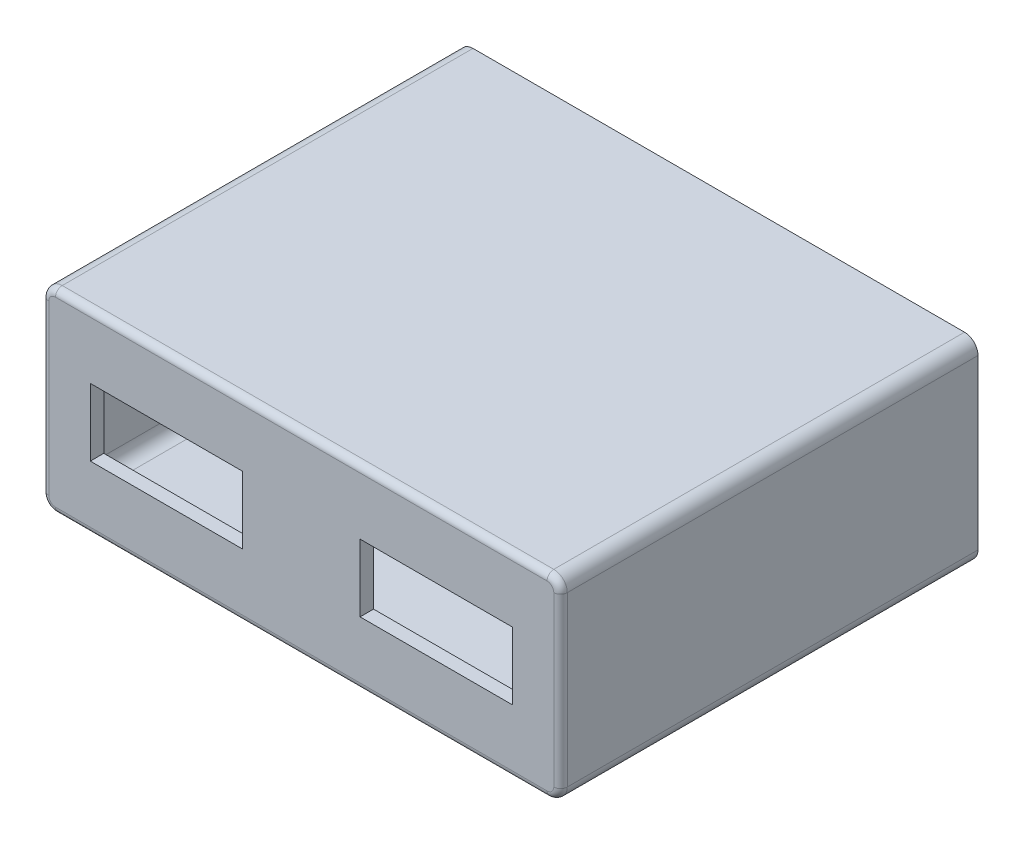
ISO-10303-21;
HEADER;
FILE_DESCRIPTION(('STEP AP214'),'2;1');
FILE_NAME('part.step','',(''),(''),'','','');
FILE_SCHEMA(('AUTOMOTIVE_DESIGN { 1 0 10303 214 1 1 1 1 }'));
ENDSEC;
DATA;
#1=APPLICATION_CONTEXT('core data for automotive mechanical design processes');
#2=APPLICATION_PROTOCOL_DEFINITION('international standard','automotive_design',2000,#1);
#3=PRODUCT_CONTEXT('',#1,'mechanical');
#4=PRODUCT('Part','Part','',(#3));
#5=PRODUCT_RELATED_PRODUCT_CATEGORY('part','',(#4));
#6=PRODUCT_DEFINITION_FORMATION('','',#4);
#7=PRODUCT_DEFINITION_CONTEXT('part definition',#1,'design');
#8=PRODUCT_DEFINITION('design','',#6,#7);
#9=PRODUCT_DEFINITION_SHAPE('','',#8);
#10=(LENGTH_UNIT() NAMED_UNIT(*) SI_UNIT(.MILLI.,.METRE.));
#11=(NAMED_UNIT(*) PLANE_ANGLE_UNIT() SI_UNIT($,.RADIAN.));
#12=(NAMED_UNIT(*) SI_UNIT($,.STERADIAN.) SOLID_ANGLE_UNIT());
#13=UNCERTAINTY_MEASURE_WITH_UNIT(LENGTH_MEASURE(1.E-05),#10,'distance_accuracy_value','');
#14=(GEOMETRIC_REPRESENTATION_CONTEXT(3) GLOBAL_UNCERTAINTY_ASSIGNED_CONTEXT((#13)) GLOBAL_UNIT_ASSIGNED_CONTEXT((#10,
#11,#12)) REPRESENTATION_CONTEXT('',''));
#15=CARTESIAN_POINT('',(0.,0.,0.));
#16=DIRECTION('',(0.,0.,1.));
#17=DIRECTION('',(1.,0.,0.));
#18=AXIS2_PLACEMENT_3D('',#15,#16,#17);
#19=CARTESIAN_POINT('',(-36.5,-12.5,55.));
#20=DIRECTION('',(0.,0.,-1.));
#21=DIRECTION('',(-1.,0.,0.));
#22=AXIS2_PLACEMENT_3D('',#19,#20,#21);
#23=CYLINDRICAL_SURFACE('',#22,2.);
#24=DIRECTION('',(0.,0.,-1.));
#25=VECTOR('',#24,1.);
#26=CARTESIAN_POINT('',(-36.5,-14.5,55.));
#27=LINE('',#26,#25);
#28=CARTESIAN_POINT('',(-36.5,-14.5,56.));
#29=VERTEX_POINT('',#28);
#30=CARTESIAN_POINT('',(-36.5,-14.5,-5.));
#31=VERTEX_POINT('',#30);
#32=EDGE_CURVE('E398',#29,#31,#27,.T.);
#33=ORIENTED_EDGE('',*,*,#32,.F.);
#34=CARTESIAN_POINT('',(-36.5,-12.5,56.));
#35=DIRECTION('',(0.,0.,1.));
#36=DIRECTION('',(1.,0.,0.));
#37=AXIS2_PLACEMENT_3D('',#34,#35,#36);
#38=CIRCLE('',#37,2.);
#39=CARTESIAN_POINT('',(-38.5,-12.5,56.));
#40=VERTEX_POINT('',#39);
#41=EDGE_CURVE('E426',#29,#40,#38,.F.);
#42=ORIENTED_EDGE('',*,*,#41,.T.);
#43=DIRECTION('',(0.,0.,-1.));
#44=VECTOR('',#43,1.);
#45=CARTESIAN_POINT('',(-38.5,-12.5,55.));
#46=LINE('',#45,#44);
#47=CARTESIAN_POINT('',(-38.5,-12.5,-5.));
#48=VERTEX_POINT('',#47);
#49=EDGE_CURVE('E384',#40,#48,#46,.T.);
#50=ORIENTED_EDGE('',*,*,#49,.T.);
#51=CARTESIAN_POINT('',(-36.5,-12.5,-5.));
#52=DIRECTION('',(0.,0.,-1.));
#53=DIRECTION('',(-1.,0.,0.));
#54=AXIS2_PLACEMENT_3D('',#51,#52,#53);
#55=CIRCLE('',#54,2.);
#56=EDGE_CURVE('E262',#31,#48,#55,.T.);
#57=ORIENTED_EDGE('',*,*,#56,.F.);
#58=EDGE_LOOP('',(#33,#42,#50,#57));
#59=FACE_BOUND('',#58,.T.);
#60=ADVANCED_FACE('F33',(#59),#23,.T.);
#61=CARTESIAN_POINT('',(36.5,-14.5,55.));
#62=DIRECTION('',(0.,1.,0.));
#63=DIRECTION('',(-1.,0.,0.));
#64=AXIS2_PLACEMENT_3D('',#61,#62,#63);
#65=PLANE('',#64);
#66=DIRECTION('',(0.,0.,-1.));
#67=VECTOR('',#66,1.);
#68=CARTESIAN_POINT('',(36.5,-14.5,55.));
#69=LINE('',#68,#67);
#70=CARTESIAN_POINT('',(36.5,-14.5,56.));
#71=VERTEX_POINT('',#70);
#72=CARTESIAN_POINT('',(36.5,-14.5,-5.));
#73=VERTEX_POINT('',#72);
#74=EDGE_CURVE('E396',#71,#73,#69,.T.);
#75=ORIENTED_EDGE('',*,*,#74,.F.);
#76=DIRECTION('',(1.,0.,0.));
#77=VECTOR('',#76,1.);
#78=CARTESIAN_POINT('',(-36.5,-14.5,56.));
#79=LINE('',#78,#77);
#80=EDGE_CURVE('E424',#71,#29,#79,.F.);
#81=ORIENTED_EDGE('',*,*,#80,.T.);
#82=ORIENTED_EDGE('',*,*,#32,.T.);
#83=DIRECTION('',(-1.,0.,0.));
#84=VECTOR('',#83,1.);
#85=CARTESIAN_POINT('',(36.5,-14.5,-5.));
#86=LINE('',#85,#84);
#87=EDGE_CURVE('E283',#73,#31,#86,.T.);
#88=ORIENTED_EDGE('',*,*,#87,.F.);
#89=EDGE_LOOP('',(#75,#81,#82,#88));
#90=FACE_BOUND('',#89,.T.);
#91=ADVANCED_FACE('F470',(#90),#65,.F.);
#92=CARTESIAN_POINT('',(36.5,-12.5,55.));
#93=DIRECTION('',(0.,0.,-1.));
#94=DIRECTION('',(-1.,0.,0.));
#95=AXIS2_PLACEMENT_3D('',#92,#93,#94);
#96=CYLINDRICAL_SURFACE('',#95,2.);
#97=DIRECTION('',(0.,0.,-1.));
#98=VECTOR('',#97,1.);
#99=CARTESIAN_POINT('',(38.5,-12.5,55.));
#100=LINE('',#99,#98);
#101=CARTESIAN_POINT('',(38.5,-12.5,56.));
#102=VERTEX_POINT('',#101);
#103=CARTESIAN_POINT('',(38.5,-12.5,-5.));
#104=VERTEX_POINT('',#103);
#105=EDGE_CURVE('E394',#102,#104,#100,.T.);
#106=ORIENTED_EDGE('',*,*,#105,.F.);
#107=CARTESIAN_POINT('',(36.5,-12.5,56.));
#108=DIRECTION('',(0.,0.,1.));
#109=DIRECTION('',(1.,0.,0.));
#110=AXIS2_PLACEMENT_3D('',#107,#108,#109);
#111=CIRCLE('',#110,2.);
#112=EDGE_CURVE('E422',#102,#71,#111,.F.);
#113=ORIENTED_EDGE('',*,*,#112,.T.);
#114=ORIENTED_EDGE('',*,*,#74,.T.);
#115=CARTESIAN_POINT('',(36.5,-12.5,-5.));
#116=DIRECTION('',(0.,0.,-1.));
#117=DIRECTION('',(-1.,0.,0.));
#118=AXIS2_PLACEMENT_3D('',#115,#116,#117);
#119=CIRCLE('',#118,2.);
#120=EDGE_CURVE('E280',#104,#73,#119,.T.);
#121=ORIENTED_EDGE('',*,*,#120,.F.);
#122=EDGE_LOOP('',(#106,#113,#114,#121));
#123=FACE_BOUND('',#122,.T.);
#124=ADVANCED_FACE('F473',(#123),#96,.T.);
#125=CARTESIAN_POINT('',(38.5,-12.5,55.));
#126=DIRECTION('',(-1.,0.,0.));
#127=DIRECTION('',(0.,0.,1.));
#128=AXIS2_PLACEMENT_3D('',#125,#126,#127);
#129=PLANE('',#128);
#130=DIRECTION('',(0.,0.,-1.));
#131=VECTOR('',#130,1.);
#132=CARTESIAN_POINT('',(38.5,12.5,55.));
#133=LINE('',#132,#131);
#134=CARTESIAN_POINT('',(38.5,12.5,56.));
#135=VERTEX_POINT('',#134);
#136=CARTESIAN_POINT('',(38.5,12.5,-5.));
#137=VERTEX_POINT('',#136);
#138=EDGE_CURVE('E392',#135,#137,#133,.T.);
#139=ORIENTED_EDGE('',*,*,#138,.F.);
#140=DIRECTION('',(0.,1.,0.));
#141=VECTOR('',#140,1.);
#142=CARTESIAN_POINT('',(38.5,-12.5,56.));
#143=LINE('',#142,#141);
#144=EDGE_CURVE('E420',#135,#102,#143,.F.);
#145=ORIENTED_EDGE('',*,*,#144,.T.);
#146=ORIENTED_EDGE('',*,*,#105,.T.);
#147=DIRECTION('',(0.,-1.,0.));
#148=VECTOR('',#147,1.);
#149=CARTESIAN_POINT('',(38.5,12.5,-5.));
#150=LINE('',#149,#148);
#151=EDGE_CURVE('E277',#137,#104,#150,.T.);
#152=ORIENTED_EDGE('',*,*,#151,.F.);
#153=EDGE_LOOP('',(#139,#145,#146,#152));
#154=FACE_BOUND('',#153,.T.);
#155=ADVANCED_FACE('F527',(#154),#129,.F.);
#156=CARTESIAN_POINT('',(36.5,12.5,55.));
#157=DIRECTION('',(0.,0.,-1.));
#158=DIRECTION('',(-1.,0.,0.));
#159=AXIS2_PLACEMENT_3D('',#156,#157,#158);
#160=CYLINDRICAL_SURFACE('',#159,2.);
#161=DIRECTION('',(0.,0.,-1.));
#162=VECTOR('',#161,1.);
#163=CARTESIAN_POINT('',(36.5,14.5,55.));
#164=LINE('',#163,#162);
#165=CARTESIAN_POINT('',(36.5,14.5,56.));
#166=VERTEX_POINT('',#165);
#167=CARTESIAN_POINT('',(36.5,14.5,-5.));
#168=VERTEX_POINT('',#167);
#169=EDGE_CURVE('E390',#166,#168,#164,.T.);
#170=ORIENTED_EDGE('',*,*,#169,.F.);
#171=CARTESIAN_POINT('',(36.5,12.5,56.));
#172=DIRECTION('',(0.,0.,1.));
#173=DIRECTION('',(1.,0.,0.));
#174=AXIS2_PLACEMENT_3D('',#171,#172,#173);
#175=CIRCLE('',#174,2.);
#176=EDGE_CURVE('E417',#166,#135,#175,.F.);
#177=ORIENTED_EDGE('',*,*,#176,.T.);
#178=ORIENTED_EDGE('',*,*,#138,.T.);
#179=CARTESIAN_POINT('',(36.5,12.5,-5.));
#180=DIRECTION('',(0.,0.,-1.));
#181=DIRECTION('',(-1.,0.,0.));
#182=AXIS2_PLACEMENT_3D('',#179,#180,#181);
#183=CIRCLE('',#182,2.);
#184=EDGE_CURVE('E274',#168,#137,#183,.T.);
#185=ORIENTED_EDGE('',*,*,#184,.F.);
#186=EDGE_LOOP('',(#170,#177,#178,#185));
#187=FACE_BOUND('',#186,.T.);
#188=ADVANCED_FACE('F506',(#187),#160,.T.);
#189=CARTESIAN_POINT('',(36.5,14.5,55.));
#190=DIRECTION('',(0.,-1.,0.));
#191=DIRECTION('',(1.,0.,0.));
#192=AXIS2_PLACEMENT_3D('',#189,#190,#191);
#193=PLANE('',#192);
#194=DIRECTION('',(0.,0.,-1.));
#195=VECTOR('',#194,1.);
#196=CARTESIAN_POINT('',(-36.5,14.5,55.));
#197=LINE('',#196,#195);
#198=CARTESIAN_POINT('',(-36.5,14.5,56.));
#199=VERTEX_POINT('',#198);
#200=CARTESIAN_POINT('',(-36.5,14.5,-5.));
#201=VERTEX_POINT('',#200);
#202=EDGE_CURVE('E388',#199,#201,#197,.T.);
#203=ORIENTED_EDGE('',*,*,#202,.F.);
#204=DIRECTION('',(-1.,0.,0.));
#205=VECTOR('',#204,1.);
#206=CARTESIAN_POINT('',(36.5,14.5,56.));
#207=LINE('',#206,#205);
#208=EDGE_CURVE('E11',#199,#166,#207,.F.);
#209=ORIENTED_EDGE('',*,*,#208,.T.);
#210=ORIENTED_EDGE('',*,*,#169,.T.);
#211=DIRECTION('',(1.,0.,0.));
#212=VECTOR('',#211,1.);
#213=CARTESIAN_POINT('',(-36.5,14.5,-5.));
#214=LINE('',#213,#212);
#215=EDGE_CURVE('E271',#201,#168,#214,.T.);
#216=ORIENTED_EDGE('',*,*,#215,.F.);
#217=EDGE_LOOP('',(#203,#209,#210,#216));
#218=FACE_BOUND('',#217,.T.);
#219=ADVANCED_FACE('F501',(#218),#193,.F.);
#220=CARTESIAN_POINT('',(-36.5,12.5,55.));
#221=DIRECTION('',(0.,0.,-1.));
#222=DIRECTION('',(-1.,0.,0.));
#223=AXIS2_PLACEMENT_3D('',#220,#221,#222);
#224=CYLINDRICAL_SURFACE('',#223,2.);
#225=DIRECTION('',(0.,0.,-1.));
#226=VECTOR('',#225,1.);
#227=CARTESIAN_POINT('',(-38.5,12.5,55.));
#228=LINE('',#227,#226);
#229=CARTESIAN_POINT('',(-38.5,12.5,56.));
#230=VERTEX_POINT('',#229);
#231=CARTESIAN_POINT('',(-38.5,12.5,-5.));
#232=VERTEX_POINT('',#231);
#233=EDGE_CURVE('E386',#230,#232,#228,.T.);
#234=ORIENTED_EDGE('',*,*,#233,.F.);
#235=CARTESIAN_POINT('',(-36.5,12.5,56.));
#236=DIRECTION('',(0.,0.,1.));
#237=DIRECTION('',(1.,0.,0.));
#238=AXIS2_PLACEMENT_3D('',#235,#236,#237);
#239=CIRCLE('',#238,2.);
#240=EDGE_CURVE('E42',#230,#199,#239,.F.);
#241=ORIENTED_EDGE('',*,*,#240,.T.);
#242=ORIENTED_EDGE('',*,*,#202,.T.);
#243=CARTESIAN_POINT('',(-36.5,12.5,-5.));
#244=DIRECTION('',(0.,0.,-1.));
#245=DIRECTION('',(-1.,0.,0.));
#246=AXIS2_PLACEMENT_3D('',#243,#244,#245);
#247=CIRCLE('',#246,2.);
#248=EDGE_CURVE('E268',#232,#201,#247,.T.);
#249=ORIENTED_EDGE('',*,*,#248,.F.);
#250=EDGE_LOOP('',(#234,#241,#242,#249));
#251=FACE_BOUND('',#250,.T.);
#252=ADVANCED_FACE('F535',(#251),#224,.T.);
#253=CARTESIAN_POINT('',(-38.5,-12.5,55.));
#254=DIRECTION('',(1.,0.,0.));
#255=DIRECTION('',(0.,0.,-1.));
#256=AXIS2_PLACEMENT_3D('',#253,#254,#255);
#257=PLANE('',#256);
#258=ORIENTED_EDGE('',*,*,#49,.F.);
#259=DIRECTION('',(0.,-1.,0.));
#260=VECTOR('',#259,1.);
#261=CARTESIAN_POINT('',(-38.5,12.5,56.));
#262=LINE('',#261,#260);
#263=EDGE_CURVE('E57',#40,#230,#262,.F.);
#264=ORIENTED_EDGE('',*,*,#263,.T.);
#265=ORIENTED_EDGE('',*,*,#233,.T.);
#266=DIRECTION('',(0.,1.,0.));
#267=VECTOR('',#266,1.);
#268=CARTESIAN_POINT('',(-38.5,-12.5,-5.));
#269=LINE('',#268,#267);
#270=EDGE_CURVE('E265',#48,#232,#269,.T.);
#271=ORIENTED_EDGE('',*,*,#270,.F.);
#272=EDGE_LOOP('',(#258,#264,#265,#271));
#273=FACE_BOUND('',#272,.T.);
#274=ADVANCED_FACE('F463',(#273),#257,.F.);
#275=CARTESIAN_POINT('',(34.5,-10.5,55.));
#276=DIRECTION('',(0.,0.,-1.));
#277=DIRECTION('',(-1.,0.,0.));
#278=AXIS2_PLACEMENT_3D('',#275,#276,#277);
#279=CYLINDRICAL_SURFACE('',#278,2.);
#280=DIRECTION('',(0.,0.,-1.));
#281=VECTOR('',#280,1.);
#282=CARTESIAN_POINT('',(36.5,-10.5,55.));
#283=LINE('',#282,#281);
#284=CARTESIAN_POINT('',(36.5,-10.5,55.));
#285=VERTEX_POINT('',#284);
#286=CARTESIAN_POINT('',(36.5,-10.5,-5.));
#287=VERTEX_POINT('',#286);
#288=EDGE_CURVE('E236',#285,#287,#283,.T.);
#289=ORIENTED_EDGE('',*,*,#288,.T.);
#290=CARTESIAN_POINT('',(34.5,-10.5,-5.));
#291=DIRECTION('',(0.,0.,-1.));
#292=DIRECTION('',(-1.,0.,0.));
#293=AXIS2_PLACEMENT_3D('',#290,#291,#292);
#294=CIRCLE('',#293,2.);
#295=CARTESIAN_POINT('',(34.5,-12.5,-5.));
#296=VERTEX_POINT('',#295);
#297=EDGE_CURVE('E233',#287,#296,#294,.T.);
#298=ORIENTED_EDGE('',*,*,#297,.T.);
#299=DIRECTION('',(0.,0.,-1.));
#300=VECTOR('',#299,1.);
#301=CARTESIAN_POINT('',(34.5,-12.5,55.));
#302=LINE('',#301,#300);
#303=CARTESIAN_POINT('',(34.5,-12.5,55.));
#304=VERTEX_POINT('',#303);
#305=EDGE_CURVE('E220',#304,#296,#302,.T.);
#306=ORIENTED_EDGE('',*,*,#305,.F.);
#307=CARTESIAN_POINT('',(34.5,-10.5,55.));
#308=DIRECTION('',(0.,0.,1.));
#309=DIRECTION('',(1.,0.,0.));
#310=AXIS2_PLACEMENT_3D('',#307,#308,#309);
#311=CIRCLE('',#310,2.);
#312=EDGE_CURVE('E351',#304,#285,#311,.T.);
#313=ORIENTED_EDGE('',*,*,#312,.T.);
#314=EDGE_LOOP('',(#289,#298,#306,#313));
#315=FACE_BOUND('',#314,.T.);
#316=ADVANCED_FACE('F234',(#315),#279,.F.);
#317=CARTESIAN_POINT('',(36.5,-10.5,55.));
#318=DIRECTION('',(-1.,0.,0.));
#319=DIRECTION('',(0.,0.,1.));
#320=AXIS2_PLACEMENT_3D('',#317,#318,#319);
#321=PLANE('',#320);
#322=DIRECTION('',(0.,0.,-1.));
#323=VECTOR('',#322,1.);
#324=CARTESIAN_POINT('',(36.5,10.5,55.));
#325=LINE('',#324,#323);
#326=CARTESIAN_POINT('',(36.5,10.5,55.));
#327=VERTEX_POINT('',#326);
#328=CARTESIAN_POINT('',(36.5,10.5,-5.));
#329=VERTEX_POINT('',#328);
#330=EDGE_CURVE('E381',#327,#329,#325,.T.);
#331=ORIENTED_EDGE('',*,*,#330,.T.);
#332=DIRECTION('',(0.,-1.,0.));
#333=VECTOR('',#332,1.);
#334=CARTESIAN_POINT('',(36.5,10.5,-5.));
#335=LINE('',#334,#333);
#336=EDGE_CURVE('E260',#329,#287,#335,.T.);
#337=ORIENTED_EDGE('',*,*,#336,.T.);
#338=ORIENTED_EDGE('',*,*,#288,.F.);
#339=DIRECTION('',(0.,1.,0.));
#340=VECTOR('',#339,1.);
#341=CARTESIAN_POINT('',(36.5,-10.5,55.));
#342=LINE('',#341,#340);
#343=EDGE_CURVE('E353',#285,#327,#342,.T.);
#344=ORIENTED_EDGE('',*,*,#343,.T.);
#345=EDGE_LOOP('',(#331,#337,#338,#344));
#346=FACE_BOUND('',#345,.T.);
#347=ADVANCED_FACE('F542',(#346),#321,.T.);
#348=CARTESIAN_POINT('',(34.5,10.5,55.));
#349=DIRECTION('',(0.,0.,-1.));
#350=DIRECTION('',(-1.,0.,0.));
#351=AXIS2_PLACEMENT_3D('',#348,#349,#350);
#352=CYLINDRICAL_SURFACE('',#351,2.);
#353=DIRECTION('',(0.,0.,-1.));
#354=VECTOR('',#353,1.);
#355=CARTESIAN_POINT('',(34.5,12.5,55.));
#356=LINE('',#355,#354);
#357=CARTESIAN_POINT('',(34.5,12.5,55.));
#358=VERTEX_POINT('',#357);
#359=CARTESIAN_POINT('',(34.5,12.5,-5.));
#360=VERTEX_POINT('',#359);
#361=EDGE_CURVE('E379',#358,#360,#356,.T.);
#362=ORIENTED_EDGE('',*,*,#361,.T.);
#363=CARTESIAN_POINT('',(34.5,10.5,-5.));
#364=DIRECTION('',(0.,0.,-1.));
#365=DIRECTION('',(-1.,0.,0.));
#366=AXIS2_PLACEMENT_3D('',#363,#364,#365);
#367=CIRCLE('',#366,2.);
#368=EDGE_CURVE('E257',#360,#329,#367,.T.);
#369=ORIENTED_EDGE('',*,*,#368,.T.);
#370=ORIENTED_EDGE('',*,*,#330,.F.);
#371=CARTESIAN_POINT('',(34.5,10.5,55.));
#372=DIRECTION('',(0.,0.,1.));
#373=DIRECTION('',(-1.,0.,0.));
#374=AXIS2_PLACEMENT_3D('',#371,#372,#373);
#375=CIRCLE('',#374,2.);
#376=EDGE_CURVE('E356',#327,#358,#375,.T.);
#377=ORIENTED_EDGE('',*,*,#376,.T.);
#378=EDGE_LOOP('',(#362,#369,#370,#377));
#379=FACE_BOUND('',#378,.T.);
#380=ADVANCED_FACE('F545',(#379),#352,.F.);
#381=CARTESIAN_POINT('',(-34.5,12.5,55.));
#382=DIRECTION('',(0.,-1.,0.));
#383=DIRECTION('',(0.,0.,-1.));
#384=AXIS2_PLACEMENT_3D('',#381,#382,#383);
#385=PLANE('',#384);
#386=DIRECTION('',(0.,0.,-1.));
#387=VECTOR('',#386,1.);
#388=CARTESIAN_POINT('',(-34.5,12.5,55.));
#389=LINE('',#388,#387);
#390=CARTESIAN_POINT('',(-34.5,12.5,55.));
#391=VERTEX_POINT('',#390);
#392=CARTESIAN_POINT('',(-34.5,12.5,-5.));
#393=VERTEX_POINT('',#392);
#394=EDGE_CURVE('E377',#391,#393,#389,.T.);
#395=ORIENTED_EDGE('',*,*,#394,.T.);
#396=DIRECTION('',(1.,0.,0.));
#397=VECTOR('',#396,1.);
#398=CARTESIAN_POINT('',(-34.5,12.5,-5.));
#399=LINE('',#398,#397);
#400=EDGE_CURVE('E254',#393,#360,#399,.T.);
#401=ORIENTED_EDGE('',*,*,#400,.T.);
#402=ORIENTED_EDGE('',*,*,#361,.F.);
#403=DIRECTION('',(-1.,0.,0.));
#404=VECTOR('',#403,1.);
#405=CARTESIAN_POINT('',(-34.5,12.5,55.));
#406=LINE('',#405,#404);
#407=EDGE_CURVE('E359',#358,#391,#406,.T.);
#408=ORIENTED_EDGE('',*,*,#407,.T.);
#409=EDGE_LOOP('',(#395,#401,#402,#408));
#410=FACE_BOUND('',#409,.T.);
#411=ADVANCED_FACE('F549',(#410),#385,.T.);
#412=CARTESIAN_POINT('',(-34.5,10.5,55.));
#413=DIRECTION('',(0.,0.,-1.));
#414=DIRECTION('',(-1.,0.,0.));
#415=AXIS2_PLACEMENT_3D('',#412,#413,#414);
#416=CYLINDRICAL_SURFACE('',#415,2.);
#417=DIRECTION('',(0.,0.,-1.));
#418=VECTOR('',#417,1.);
#419=CARTESIAN_POINT('',(-36.5,10.5,55.));
#420=LINE('',#419,#418);
#421=CARTESIAN_POINT('',(-36.5,10.5,55.));
#422=VERTEX_POINT('',#421);
#423=CARTESIAN_POINT('',(-36.5,10.5,-5.));
#424=VERTEX_POINT('',#423);
#425=EDGE_CURVE('E375',#422,#424,#420,.T.);
#426=ORIENTED_EDGE('',*,*,#425,.T.);
#427=CARTESIAN_POINT('',(-34.5,10.5,-5.));
#428=DIRECTION('',(0.,0.,-1.));
#429=DIRECTION('',(-1.,0.,0.));
#430=AXIS2_PLACEMENT_3D('',#427,#428,#429);
#431=CIRCLE('',#430,2.);
#432=EDGE_CURVE('E251',#424,#393,#431,.T.);
#433=ORIENTED_EDGE('',*,*,#432,.T.);
#434=ORIENTED_EDGE('',*,*,#394,.F.);
#435=CARTESIAN_POINT('',(-34.5,10.5,55.));
#436=DIRECTION('',(0.,0.,1.));
#437=DIRECTION('',(-1.,0.,0.));
#438=AXIS2_PLACEMENT_3D('',#435,#436,#437);
#439=CIRCLE('',#438,2.);
#440=EDGE_CURVE('E362',#391,#422,#439,.T.);
#441=ORIENTED_EDGE('',*,*,#440,.T.);
#442=EDGE_LOOP('',(#426,#433,#434,#441));
#443=FACE_BOUND('',#442,.T.);
#444=ADVANCED_FACE('F553',(#443),#416,.F.);
#445=CARTESIAN_POINT('',(-36.5,-10.5,55.));
#446=DIRECTION('',(1.,0.,0.));
#447=DIRECTION('',(0.,0.,-1.));
#448=AXIS2_PLACEMENT_3D('',#445,#446,#447);
#449=PLANE('',#448);
#450=DIRECTION('',(0.,0.,-1.));
#451=VECTOR('',#450,1.);
#452=CARTESIAN_POINT('',(-36.5,-10.5,55.));
#453=LINE('',#452,#451);
#454=CARTESIAN_POINT('',(-36.5,-10.5,55.));
#455=VERTEX_POINT('',#454);
#456=CARTESIAN_POINT('',(-36.5,-10.5,-5.));
#457=VERTEX_POINT('',#456);
#458=EDGE_CURVE('E373',#455,#457,#453,.T.);
#459=ORIENTED_EDGE('',*,*,#458,.T.);
#460=DIRECTION('',(0.,1.,0.));
#461=VECTOR('',#460,1.);
#462=CARTESIAN_POINT('',(-36.5,-10.5,-5.));
#463=LINE('',#462,#461);
#464=EDGE_CURVE('E246',#457,#424,#463,.T.);
#465=ORIENTED_EDGE('',*,*,#464,.T.);
#466=ORIENTED_EDGE('',*,*,#425,.F.);
#467=DIRECTION('',(0.,-1.,0.));
#468=VECTOR('',#467,1.);
#469=CARTESIAN_POINT('',(-36.5,-10.5,55.));
#470=LINE('',#469,#468);
#471=EDGE_CURVE('E365',#422,#455,#470,.T.);
#472=ORIENTED_EDGE('',*,*,#471,.T.);
#473=EDGE_LOOP('',(#459,#465,#466,#472));
#474=FACE_BOUND('',#473,.T.);
#475=ADVANCED_FACE('F557',(#474),#449,.T.);
#476=CARTESIAN_POINT('',(-34.5,-10.5,55.));
#477=DIRECTION('',(0.,0.,-1.));
#478=DIRECTION('',(-1.,0.,0.));
#479=AXIS2_PLACEMENT_3D('',#476,#477,#478);
#480=CYLINDRICAL_SURFACE('',#479,2.);
#481=DIRECTION('',(0.,0.,-1.));
#482=VECTOR('',#481,1.);
#483=CARTESIAN_POINT('',(-34.5,-12.5,55.));
#484=LINE('',#483,#482);
#485=CARTESIAN_POINT('',(-34.5,-12.5,55.));
#486=VERTEX_POINT('',#485);
#487=CARTESIAN_POINT('',(-34.5,-12.5,-5.));
#488=VERTEX_POINT('',#487);
#489=EDGE_CURVE('E230',#486,#488,#484,.T.);
#490=ORIENTED_EDGE('',*,*,#489,.T.);
#491=CARTESIAN_POINT('',(-34.5,-10.5,-5.));
#492=DIRECTION('',(0.,0.,-1.));
#493=DIRECTION('',(-1.,0.,0.));
#494=AXIS2_PLACEMENT_3D('',#491,#492,#493);
#495=CIRCLE('',#494,2.);
#496=EDGE_CURVE('E244',#488,#457,#495,.T.);
#497=ORIENTED_EDGE('',*,*,#496,.T.);
#498=ORIENTED_EDGE('',*,*,#458,.F.);
#499=CARTESIAN_POINT('',(-34.5,-10.5,55.));
#500=DIRECTION('',(0.,0.,1.));
#501=DIRECTION('',(-1.,0.,0.));
#502=AXIS2_PLACEMENT_3D('',#499,#500,#501);
#503=CIRCLE('',#502,2.);
#504=EDGE_CURVE('E368',#455,#486,#503,.T.);
#505=ORIENTED_EDGE('',*,*,#504,.T.);
#506=EDGE_LOOP('',(#490,#497,#498,#505));
#507=FACE_BOUND('',#506,.T.);
#508=ADVANCED_FACE('F561',(#507),#480,.F.);
#509=CARTESIAN_POINT('',(-34.5,-12.5,55.));
#510=DIRECTION('',(0.,1.,0.));
#511=DIRECTION('',(0.,0.,1.));
#512=AXIS2_PLACEMENT_3D('',#509,#510,#511);
#513=PLANE('',#512);
#514=ORIENTED_EDGE('',*,*,#305,.T.);
#515=DIRECTION('',(-1.,0.,0.));
#516=VECTOR('',#515,1.);
#517=CARTESIAN_POINT('',(34.5,-12.5,-5.));
#518=LINE('',#517,#516);
#519=EDGE_CURVE('E225',#296,#488,#518,.T.);
#520=ORIENTED_EDGE('',*,*,#519,.T.);
#521=ORIENTED_EDGE('',*,*,#489,.F.);
#522=DIRECTION('',(1.,0.,0.));
#523=VECTOR('',#522,1.);
#524=CARTESIAN_POINT('',(-34.5,-12.5,55.));
#525=LINE('',#524,#523);
#526=EDGE_CURVE('E227',#486,#304,#525,.T.);
#527=ORIENTED_EDGE('',*,*,#526,.T.);
#528=EDGE_LOOP('',(#514,#520,#521,#527));
#529=FACE_BOUND('',#528,.T.);
#530=ADVANCED_FACE('F222',(#529),#513,.T.);
#531=CARTESIAN_POINT('',(-36.5,-12.5,55.));
#532=DIRECTION('',(0.,0.,1.));
#533=DIRECTION('',(1.,0.,0.));
#534=AXIS2_PLACEMENT_3D('',#531,#532,#533);
#535=PLANE('',#534);
#536=DIRECTION('',(1.,0.,0.));
#537=VECTOR('',#536,1.);
#538=CARTESIAN_POINT('',(-36.5,-5.,55.));
#539=LINE('',#538,#537);
#540=CARTESIAN_POINT('',(8.73338660184416,-5.,55.));
#541=VERTEX_POINT('',#540);
#542=CARTESIAN_POINT('',(31.3333866018442,-5.,55.));
#543=VERTEX_POINT('',#542);
#544=EDGE_CURVE('E313',#541,#543,#539,.T.);
#545=ORIENTED_EDGE('',*,*,#544,.T.);
#546=DIRECTION('',(0.,1.,0.));
#547=VECTOR('',#546,1.);
#548=CARTESIAN_POINT('',(31.3333866018442,-12.5,55.));
#549=LINE('',#548,#547);
#550=CARTESIAN_POINT('',(31.3333866018442,5.,55.));
#551=VERTEX_POINT('',#550);
#552=EDGE_CURVE('E316',#543,#551,#549,.T.);
#553=ORIENTED_EDGE('',*,*,#552,.T.);
#554=DIRECTION('',(-1.,0.,0.));
#555=VECTOR('',#554,1.);
#556=CARTESIAN_POINT('',(-36.5,5.,55.));
#557=LINE('',#556,#555);
#558=CARTESIAN_POINT('',(8.73338660184416,5.,55.));
#559=VERTEX_POINT('',#558);
#560=EDGE_CURVE('E301',#551,#559,#557,.T.);
#561=ORIENTED_EDGE('',*,*,#560,.T.);
#562=DIRECTION('',(0.,-1.,0.));
#563=VECTOR('',#562,1.);
#564=CARTESIAN_POINT('',(8.73338660184415,-12.5,55.));
#565=LINE('',#564,#563);
#566=EDGE_CURVE('E310',#559,#541,#565,.T.);
#567=ORIENTED_EDGE('',*,*,#566,.T.);
#568=EDGE_LOOP('',(#545,#553,#561,#567));
#569=FACE_BOUND('',#568,.T.);
#570=DIRECTION('',(1.,0.,0.));
#571=VECTOR('',#570,1.);
#572=CARTESIAN_POINT('',(-36.5,-5.,55.));
#573=LINE('',#572,#571);
#574=CARTESIAN_POINT('',(-31.3333866018442,-5.,55.));
#575=VERTEX_POINT('',#574);
#576=CARTESIAN_POINT('',(-8.73338660184416,-5.,55.));
#577=VERTEX_POINT('',#576);
#578=EDGE_CURVE('E345',#575,#577,#573,.T.);
#579=ORIENTED_EDGE('',*,*,#578,.T.);
#580=DIRECTION('',(0.,1.,0.));
#581=VECTOR('',#580,1.);
#582=CARTESIAN_POINT('',(-8.73338660184416,-12.5,55.));
#583=LINE('',#582,#581);
#584=CARTESIAN_POINT('',(-8.73338660184416,5.,55.));
#585=VERTEX_POINT('',#584);
#586=EDGE_CURVE('E348',#577,#585,#583,.T.);
#587=ORIENTED_EDGE('',*,*,#586,.T.);
#588=DIRECTION('',(-1.,0.,0.));
#589=VECTOR('',#588,1.);
#590=CARTESIAN_POINT('',(-36.5,5.,55.));
#591=LINE('',#590,#589);
#592=CARTESIAN_POINT('',(-31.3333866018442,5.,55.));
#593=VERTEX_POINT('',#592);
#594=EDGE_CURVE('E333',#585,#593,#591,.T.);
#595=ORIENTED_EDGE('',*,*,#594,.T.);
#596=DIRECTION('',(0.,-1.,0.));
#597=VECTOR('',#596,1.);
#598=CARTESIAN_POINT('',(-31.3333866018442,-12.5,55.));
#599=LINE('',#598,#597);
#600=EDGE_CURVE('E342',#593,#575,#599,.T.);
#601=ORIENTED_EDGE('',*,*,#600,.T.);
#602=EDGE_LOOP('',(#579,#587,#595,#601));
#603=FACE_BOUND('',#602,.T.);
#604=ORIENTED_EDGE('',*,*,#312,.F.);
#605=ORIENTED_EDGE('',*,*,#526,.F.);
#606=ORIENTED_EDGE('',*,*,#504,.F.);
#607=ORIENTED_EDGE('',*,*,#471,.F.);
#608=ORIENTED_EDGE('',*,*,#440,.F.);
#609=ORIENTED_EDGE('',*,*,#407,.F.);
#610=ORIENTED_EDGE('',*,*,#376,.F.);
#611=ORIENTED_EDGE('',*,*,#343,.F.);
#612=EDGE_LOOP('',(#604,#605,#606,#607,#608,#609,#610,#611));
#613=FACE_BOUND('',#612,.T.);
#614=ADVANCED_FACE('F568',(#569,#603,#613),#535,.F.);
#615=CARTESIAN_POINT('',(-36.5,-12.5,57.));
#616=DIRECTION('',(0.,0.,1.));
#617=DIRECTION('',(1.,0.,0.));
#618=AXIS2_PLACEMENT_3D('',#615,#616,#617);
#619=PLANE('',#618);
#620=DIRECTION('',(0.,1.,0.));
#621=VECTOR('',#620,1.);
#622=CARTESIAN_POINT('',(37.5,12.5,57.));
#623=LINE('',#622,#621);
#624=CARTESIAN_POINT('',(37.5,-12.5,57.));
#625=VERTEX_POINT('',#624);
#626=CARTESIAN_POINT('',(37.5,12.5,57.));
#627=VERTEX_POINT('',#626);
#628=EDGE_CURVE('E412',#625,#627,#623,.T.);
#629=ORIENTED_EDGE('',*,*,#628,.T.);
#630=CARTESIAN_POINT('',(36.5,12.5,57.));
#631=DIRECTION('',(0.,0.,1.));
#632=DIRECTION('',(1.,0.,0.));
#633=AXIS2_PLACEMENT_3D('',#630,#631,#632);
#634=CIRCLE('',#633,1.);
#635=CARTESIAN_POINT('',(36.5,13.5,57.));
#636=VERTEX_POINT('',#635);
#637=EDGE_CURVE('E414',#627,#636,#634,.T.);
#638=ORIENTED_EDGE('',*,*,#637,.T.);
#639=DIRECTION('',(-1.,0.,0.));
#640=VECTOR('',#639,1.);
#641=CARTESIAN_POINT('',(-36.5,13.5,57.));
#642=LINE('',#641,#640);
#643=CARTESIAN_POINT('',(-36.5,13.5,57.));
#644=VERTEX_POINT('',#643);
#645=EDGE_CURVE('E400',#636,#644,#642,.T.);
#646=ORIENTED_EDGE('',*,*,#645,.T.);
#647=CARTESIAN_POINT('',(-36.5,12.5,57.));
#648=DIRECTION('',(0.,0.,1.));
#649=DIRECTION('',(1.,0.,0.));
#650=AXIS2_PLACEMENT_3D('',#647,#648,#649);
#651=CIRCLE('',#650,1.);
#652=CARTESIAN_POINT('',(-37.5,12.5,57.));
#653=VERTEX_POINT('',#652);
#654=EDGE_CURVE('E402',#644,#653,#651,.T.);
#655=ORIENTED_EDGE('',*,*,#654,.T.);
#656=DIRECTION('',(0.,-1.,0.));
#657=VECTOR('',#656,1.);
#658=CARTESIAN_POINT('',(-37.5,-12.5,57.));
#659=LINE('',#658,#657);
#660=CARTESIAN_POINT('',(-37.5,-12.5,57.));
#661=VERTEX_POINT('',#660);
#662=EDGE_CURVE('E404',#653,#661,#659,.T.);
#663=ORIENTED_EDGE('',*,*,#662,.T.);
#664=CARTESIAN_POINT('',(-36.5,-12.5,57.));
#665=DIRECTION('',(0.,0.,1.));
#666=DIRECTION('',(1.,0.,0.));
#667=AXIS2_PLACEMENT_3D('',#664,#665,#666);
#668=CIRCLE('',#667,1.);
#669=CARTESIAN_POINT('',(-36.5,-13.5,57.));
#670=VERTEX_POINT('',#669);
#671=EDGE_CURVE('E406',#661,#670,#668,.T.);
#672=ORIENTED_EDGE('',*,*,#671,.T.);
#673=DIRECTION('',(1.,0.,0.));
#674=VECTOR('',#673,1.);
#675=CARTESIAN_POINT('',(36.5,-13.5,57.));
#676=LINE('',#675,#674);
#677=CARTESIAN_POINT('',(36.5,-13.5,57.));
#678=VERTEX_POINT('',#677);
#679=EDGE_CURVE('E408',#670,#678,#676,.T.);
#680=ORIENTED_EDGE('',*,*,#679,.T.);
#681=CARTESIAN_POINT('',(36.5,-12.5,57.));
#682=DIRECTION('',(0.,0.,1.));
#683=DIRECTION('',(1.,0.,0.));
#684=AXIS2_PLACEMENT_3D('',#681,#682,#683);
#685=CIRCLE('',#684,1.);
#686=EDGE_CURVE('E410',#678,#625,#685,.T.);
#687=ORIENTED_EDGE('',*,*,#686,.T.);
#688=EDGE_LOOP('',(#629,#638,#646,#655,#663,#672,#680,#687));
#689=FACE_BOUND('',#688,.T.);
#690=DIRECTION('',(0.,1.,0.));
#691=VECTOR('',#690,1.);
#692=CARTESIAN_POINT('',(31.3333866018442,5.,57.));
#693=LINE('',#692,#691);
#694=CARTESIAN_POINT('',(31.3333866018442,-5.,57.));
#695=VERTEX_POINT('',#694);
#696=CARTESIAN_POINT('',(31.3333866018442,5.,57.));
#697=VERTEX_POINT('',#696);
#698=EDGE_CURVE('E287',#695,#697,#693,.T.);
#699=ORIENTED_EDGE('',*,*,#698,.F.);
#700=DIRECTION('',(1.,0.,0.));
#701=VECTOR('',#700,1.);
#702=CARTESIAN_POINT('',(31.3333866018442,-5.,57.));
#703=LINE('',#702,#701);
#704=CARTESIAN_POINT('',(8.73338660184416,-5.,57.));
#705=VERTEX_POINT('',#704);
#706=EDGE_CURVE('E295',#705,#695,#703,.T.);
#707=ORIENTED_EDGE('',*,*,#706,.F.);
#708=DIRECTION('',(0.,-1.,0.));
#709=VECTOR('',#708,1.);
#710=CARTESIAN_POINT('',(8.73338660184416,5.,57.));
#711=LINE('',#710,#709);
#712=CARTESIAN_POINT('',(8.73338660184416,5.,57.));
#713=VERTEX_POINT('',#712);
#714=EDGE_CURVE('E292',#713,#705,#711,.T.);
#715=ORIENTED_EDGE('',*,*,#714,.F.);
#716=DIRECTION('',(-1.,0.,0.));
#717=VECTOR('',#716,1.);
#718=CARTESIAN_POINT('',(31.3333866018442,5.,57.));
#719=LINE('',#718,#717);
#720=EDGE_CURVE('E289',#697,#713,#719,.T.);
#721=ORIENTED_EDGE('',*,*,#720,.F.);
#722=EDGE_LOOP('',(#699,#707,#715,#721));
#723=FACE_BOUND('',#722,.T.);
#724=DIRECTION('',(0.,1.,0.));
#725=VECTOR('',#724,1.);
#726=CARTESIAN_POINT('',(-8.73338660184416,5.,57.));
#727=LINE('',#726,#725);
#728=CARTESIAN_POINT('',(-8.73338660184416,-5.,57.));
#729=VERTEX_POINT('',#728);
#730=CARTESIAN_POINT('',(-8.73338660184416,5.,57.));
#731=VERTEX_POINT('',#730);
#732=EDGE_CURVE('E319',#729,#731,#727,.T.);
#733=ORIENTED_EDGE('',*,*,#732,.F.);
#734=DIRECTION('',(1.,0.,0.));
#735=VECTOR('',#734,1.);
#736=CARTESIAN_POINT('',(-31.3333866018442,-5.,57.));
#737=LINE('',#736,#735);
#738=CARTESIAN_POINT('',(-31.3333866018442,-5.,57.));
#739=VERTEX_POINT('',#738);
#740=EDGE_CURVE('E327',#739,#729,#737,.T.);
#741=ORIENTED_EDGE('',*,*,#740,.F.);
#742=DIRECTION('',(0.,-1.,0.));
#743=VECTOR('',#742,1.);
#744=CARTESIAN_POINT('',(-31.3333866018442,5.,57.));
#745=LINE('',#744,#743);
#746=CARTESIAN_POINT('',(-31.3333866018442,5.,57.));
#747=VERTEX_POINT('',#746);
#748=EDGE_CURVE('E324',#747,#739,#745,.T.);
#749=ORIENTED_EDGE('',*,*,#748,.F.);
#750=DIRECTION('',(-1.,0.,0.));
#751=VECTOR('',#750,1.);
#752=CARTESIAN_POINT('',(-31.3333866018442,5.,57.));
#753=LINE('',#752,#751);
#754=EDGE_CURVE('E321',#731,#747,#753,.T.);
#755=ORIENTED_EDGE('',*,*,#754,.F.);
#756=EDGE_LOOP('',(#733,#741,#749,#755));
#757=FACE_BOUND('',#756,.T.);
#758=ADVANCED_FACE('F486',(#689,#723,#757),#619,.T.);
#759=CARTESIAN_POINT('',(-8.73338660184416,5.,45.));
#760=DIRECTION('',(1.,0.,0.));
#761=DIRECTION('',(0.,0.,-1.));
#762=AXIS2_PLACEMENT_3D('',#759,#760,#761);
#763=PLANE('',#762);
#764=DIRECTION('',(0.,0.,1.));
#765=VECTOR('',#764,1.);
#766=CARTESIAN_POINT('',(-8.73338660184416,-5.,45.));
#767=LINE('',#766,#765);
#768=EDGE_CURVE('E331',#577,#729,#767,.T.);
#769=ORIENTED_EDGE('',*,*,#768,.T.);
#770=ORIENTED_EDGE('',*,*,#732,.T.);
#771=DIRECTION('',(0.,0.,1.));
#772=VECTOR('',#771,1.);
#773=CARTESIAN_POINT('',(-8.73338660184416,5.,45.));
#774=LINE('',#773,#772);
#775=EDGE_CURVE('E330',#585,#731,#774,.T.);
#776=ORIENTED_EDGE('',*,*,#775,.F.);
#777=ORIENTED_EDGE('',*,*,#586,.F.);
#778=EDGE_LOOP('',(#769,#770,#776,#777));
#779=FACE_BOUND('',#778,.T.);
#780=ADVANCED_FACE('F574',(#779),#763,.F.);
#781=CARTESIAN_POINT('',(-31.3333866018442,-5.,45.));
#782=DIRECTION('',(0.,-1.,0.));
#783=DIRECTION('',(0.,0.,-1.));
#784=AXIS2_PLACEMENT_3D('',#781,#782,#783);
#785=PLANE('',#784);
#786=DIRECTION('',(0.,0.,1.));
#787=VECTOR('',#786,1.);
#788=CARTESIAN_POINT('',(-31.3333866018442,-5.,45.));
#789=LINE('',#788,#787);
#790=EDGE_CURVE('E334',#575,#739,#789,.T.);
#791=ORIENTED_EDGE('',*,*,#790,.T.);
#792=ORIENTED_EDGE('',*,*,#740,.T.);
#793=ORIENTED_EDGE('',*,*,#768,.F.);
#794=ORIENTED_EDGE('',*,*,#578,.F.);
#795=EDGE_LOOP('',(#791,#792,#793,#794));
#796=FACE_BOUND('',#795,.T.);
#797=ADVANCED_FACE('F577',(#796),#785,.F.);
#798=CARTESIAN_POINT('',(-31.3333866018442,5.,45.));
#799=DIRECTION('',(-1.,0.,0.));
#800=DIRECTION('',(0.,0.,1.));
#801=AXIS2_PLACEMENT_3D('',#798,#799,#800);
#802=PLANE('',#801);
#803=DIRECTION('',(0.,0.,1.));
#804=VECTOR('',#803,1.);
#805=CARTESIAN_POINT('',(-31.3333866018442,5.,45.));
#806=LINE('',#805,#804);
#807=EDGE_CURVE('E336',#593,#747,#806,.T.);
#808=ORIENTED_EDGE('',*,*,#807,.T.);
#809=ORIENTED_EDGE('',*,*,#748,.T.);
#810=ORIENTED_EDGE('',*,*,#790,.F.);
#811=ORIENTED_EDGE('',*,*,#600,.F.);
#812=EDGE_LOOP('',(#808,#809,#810,#811));
#813=FACE_BOUND('',#812,.T.);
#814=ADVANCED_FACE('F583',(#813),#802,.F.);
#815=CARTESIAN_POINT('',(-31.3333866018442,5.,45.));
#816=DIRECTION('',(0.,1.,0.));
#817=DIRECTION('',(0.,0.,1.));
#818=AXIS2_PLACEMENT_3D('',#815,#816,#817);
#819=PLANE('',#818);
#820=ORIENTED_EDGE('',*,*,#775,.T.);
#821=ORIENTED_EDGE('',*,*,#754,.T.);
#822=ORIENTED_EDGE('',*,*,#807,.F.);
#823=ORIENTED_EDGE('',*,*,#594,.F.);
#824=EDGE_LOOP('',(#820,#821,#822,#823));
#825=FACE_BOUND('',#824,.T.);
#826=ADVANCED_FACE('F579',(#825),#819,.F.);
#827=CARTESIAN_POINT('',(31.3333866018442,5.,45.));
#828=DIRECTION('',(1.,0.,0.));
#829=DIRECTION('',(0.,0.,-1.));
#830=AXIS2_PLACEMENT_3D('',#827,#828,#829);
#831=PLANE('',#830);
#832=DIRECTION('',(0.,0.,1.));
#833=VECTOR('',#832,1.);
#834=CARTESIAN_POINT('',(31.3333866018442,-5.,45.));
#835=LINE('',#834,#833);
#836=EDGE_CURVE('E299',#543,#695,#835,.T.);
#837=ORIENTED_EDGE('',*,*,#836,.T.);
#838=ORIENTED_EDGE('',*,*,#698,.T.);
#839=DIRECTION('',(0.,0.,1.));
#840=VECTOR('',#839,1.);
#841=CARTESIAN_POINT('',(31.3333866018442,5.,45.));
#842=LINE('',#841,#840);
#843=EDGE_CURVE('E298',#551,#697,#842,.T.);
#844=ORIENTED_EDGE('',*,*,#843,.F.);
#845=ORIENTED_EDGE('',*,*,#552,.F.);
#846=EDGE_LOOP('',(#837,#838,#844,#845));
#847=FACE_BOUND('',#846,.T.);
#848=ADVANCED_FACE('F582',(#847),#831,.F.);
#849=CARTESIAN_POINT('',(31.3333866018442,-5.,45.));
#850=DIRECTION('',(0.,-1.,0.));
#851=DIRECTION('',(0.,0.,-1.));
#852=AXIS2_PLACEMENT_3D('',#849,#850,#851);
#853=PLANE('',#852);
#854=DIRECTION('',(0.,0.,1.));
#855=VECTOR('',#854,1.);
#856=CARTESIAN_POINT('',(8.73338660184416,-5.,45.));
#857=LINE('',#856,#855);
#858=EDGE_CURVE('E302',#541,#705,#857,.T.);
#859=ORIENTED_EDGE('',*,*,#858,.T.);
#860=ORIENTED_EDGE('',*,*,#706,.T.);
#861=ORIENTED_EDGE('',*,*,#836,.F.);
#862=ORIENTED_EDGE('',*,*,#544,.F.);
#863=EDGE_LOOP('',(#859,#860,#861,#862));
#864=FACE_BOUND('',#863,.T.);
#865=ADVANCED_FACE('F593',(#864),#853,.F.);
#866=CARTESIAN_POINT('',(8.73338660184416,5.,45.));
#867=DIRECTION('',(-1.,0.,0.));
#868=DIRECTION('',(0.,0.,1.));
#869=AXIS2_PLACEMENT_3D('',#866,#867,#868);
#870=PLANE('',#869);
#871=DIRECTION('',(0.,0.,1.));
#872=VECTOR('',#871,1.);
#873=CARTESIAN_POINT('',(8.73338660184416,5.,45.));
#874=LINE('',#873,#872);
#875=EDGE_CURVE('E304',#559,#713,#874,.T.);
#876=ORIENTED_EDGE('',*,*,#875,.T.);
#877=ORIENTED_EDGE('',*,*,#714,.T.);
#878=ORIENTED_EDGE('',*,*,#858,.F.);
#879=ORIENTED_EDGE('',*,*,#566,.F.);
#880=EDGE_LOOP('',(#876,#877,#878,#879));
#881=FACE_BOUND('',#880,.T.);
#882=ADVANCED_FACE('F598',(#881),#870,.F.);
#883=CARTESIAN_POINT('',(31.3333866018442,5.,45.));
#884=DIRECTION('',(0.,1.,0.));
#885=DIRECTION('',(0.,0.,1.));
#886=AXIS2_PLACEMENT_3D('',#883,#884,#885);
#887=PLANE('',#886);
#888=ORIENTED_EDGE('',*,*,#843,.T.);
#889=ORIENTED_EDGE('',*,*,#720,.T.);
#890=ORIENTED_EDGE('',*,*,#875,.F.);
#891=ORIENTED_EDGE('',*,*,#560,.F.);
#892=EDGE_LOOP('',(#888,#889,#890,#891));
#893=FACE_BOUND('',#892,.T.);
#894=ADVANCED_FACE('F595',(#893),#887,.F.);
#895=CARTESIAN_POINT('',(-36.5,-12.5,56.));
#896=DIRECTION('',(0.,0.,1.));
#897=DIRECTION('',(1.,0.,0.));
#898=AXIS2_PLACEMENT_3D('',#895,#896,#897);
#899=TOROIDAL_SURFACE('',#898,1.,1.);
#900=CARTESIAN_POINT('',(-37.5,-12.5,56.));
#901=DIRECTION('',(0.,1.,0.));
#902=DIRECTION('',(0.,0.,1.));
#903=AXIS2_PLACEMENT_3D('',#900,#901,#902);
#904=CIRCLE('',#903,1.);
#905=EDGE_CURVE('E444',#40,#661,#904,.T.);
#906=ORIENTED_EDGE('',*,*,#905,.F.);
#907=ORIENTED_EDGE('',*,*,#41,.F.);
#908=CARTESIAN_POINT('',(-36.5,-13.5,56.));
#909=DIRECTION('',(1.,0.,0.));
#910=DIRECTION('',(0.,0.,-1.));
#911=AXIS2_PLACEMENT_3D('',#908,#909,#910);
#912=CIRCLE('',#911,1.);
#913=EDGE_CURVE('E37',#670,#29,#912,.T.);
#914=ORIENTED_EDGE('',*,*,#913,.F.);
#915=ORIENTED_EDGE('',*,*,#671,.F.);
#916=EDGE_LOOP('',(#906,#907,#914,#915));
#917=FACE_BOUND('',#916,.T.);
#918=ADVANCED_FACE('F35',(#917),#899,.T.);
#919=CARTESIAN_POINT('',(-36.5,-13.5,56.));
#920=DIRECTION('',(-1.,0.,0.));
#921=DIRECTION('',(0.,-1.,0.));
#922=AXIS2_PLACEMENT_3D('',#919,#920,#921);
#923=CYLINDRICAL_SURFACE('',#922,1.);
#924=ORIENTED_EDGE('',*,*,#913,.T.);
#925=ORIENTED_EDGE('',*,*,#80,.F.);
#926=CARTESIAN_POINT('',(36.5,-13.5,56.));
#927=DIRECTION('',(1.,0.,0.));
#928=DIRECTION('',(0.,0.,-1.));
#929=AXIS2_PLACEMENT_3D('',#926,#927,#928);
#930=CIRCLE('',#929,1.);
#931=EDGE_CURVE('E442',#678,#71,#930,.T.);
#932=ORIENTED_EDGE('',*,*,#931,.F.);
#933=ORIENTED_EDGE('',*,*,#679,.F.);
#934=EDGE_LOOP('',(#924,#925,#932,#933));
#935=FACE_BOUND('',#934,.T.);
#936=ADVANCED_FACE('F454',(#935),#923,.T.);
#937=CARTESIAN_POINT('',(-37.5,-12.5,56.));
#938=DIRECTION('',(0.,1.,0.));
#939=DIRECTION('',(0.,0.,1.));
#940=AXIS2_PLACEMENT_3D('',#937,#938,#939);
#941=CYLINDRICAL_SURFACE('',#940,1.);
#942=ORIENTED_EDGE('',*,*,#905,.T.);
#943=ORIENTED_EDGE('',*,*,#662,.F.);
#944=CARTESIAN_POINT('',(-37.5,12.5,56.));
#945=DIRECTION('',(0.,1.,0.));
#946=DIRECTION('',(0.,0.,1.));
#947=AXIS2_PLACEMENT_3D('',#944,#945,#946);
#948=CIRCLE('',#947,1.);
#949=EDGE_CURVE('E439',#230,#653,#948,.T.);
#950=ORIENTED_EDGE('',*,*,#949,.F.);
#951=ORIENTED_EDGE('',*,*,#263,.F.);
#952=EDGE_LOOP('',(#942,#943,#950,#951));
#953=FACE_BOUND('',#952,.T.);
#954=ADVANCED_FACE('F490',(#953),#941,.T.);
#955=CARTESIAN_POINT('',(36.5,-12.5,56.));
#956=DIRECTION('',(0.,0.,1.));
#957=DIRECTION('',(1.,0.,0.));
#958=AXIS2_PLACEMENT_3D('',#955,#956,#957);
#959=TOROIDAL_SURFACE('',#958,1.,1.);
#960=ORIENTED_EDGE('',*,*,#931,.T.);
#961=ORIENTED_EDGE('',*,*,#112,.F.);
#962=CARTESIAN_POINT('',(37.5,-12.5,56.));
#963=DIRECTION('',(0.,1.,0.));
#964=DIRECTION('',(0.,0.,1.));
#965=AXIS2_PLACEMENT_3D('',#962,#963,#964);
#966=CIRCLE('',#965,1.);
#967=EDGE_CURVE('E436',#625,#102,#966,.T.);
#968=ORIENTED_EDGE('',*,*,#967,.F.);
#969=ORIENTED_EDGE('',*,*,#686,.F.);
#970=EDGE_LOOP('',(#960,#961,#968,#969));
#971=FACE_BOUND('',#970,.T.);
#972=ADVANCED_FACE('F477',(#971),#959,.T.);
#973=CARTESIAN_POINT('',(-36.5,12.5,56.));
#974=DIRECTION('',(0.,0.,1.));
#975=DIRECTION('',(1.,0.,0.));
#976=AXIS2_PLACEMENT_3D('',#973,#974,#975);
#977=TOROIDAL_SURFACE('',#976,1.,1.);
#978=ORIENTED_EDGE('',*,*,#949,.T.);
#979=ORIENTED_EDGE('',*,*,#654,.F.);
#980=CARTESIAN_POINT('',(-36.5,13.5,56.));
#981=DIRECTION('',(1.,0.,0.));
#982=DIRECTION('',(0.,0.,-1.));
#983=AXIS2_PLACEMENT_3D('',#980,#981,#982);
#984=CIRCLE('',#983,1.);
#985=EDGE_CURVE('E433',#199,#644,#984,.T.);
#986=ORIENTED_EDGE('',*,*,#985,.F.);
#987=ORIENTED_EDGE('',*,*,#240,.F.);
#988=EDGE_LOOP('',(#978,#979,#986,#987));
#989=FACE_BOUND('',#988,.T.);
#990=ADVANCED_FACE('F492',(#989),#977,.T.);
#991=CARTESIAN_POINT('',(37.5,-12.5,56.));
#992=DIRECTION('',(0.,-1.,0.));
#993=DIRECTION('',(0.,0.,-1.));
#994=AXIS2_PLACEMENT_3D('',#991,#992,#993);
#995=CYLINDRICAL_SURFACE('',#994,1.);
#996=ORIENTED_EDGE('',*,*,#967,.T.);
#997=ORIENTED_EDGE('',*,*,#144,.F.);
#998=CARTESIAN_POINT('',(37.5,12.5,56.));
#999=DIRECTION('',(0.,1.,0.));
#1000=DIRECTION('',(0.,0.,1.));
#1001=AXIS2_PLACEMENT_3D('',#998,#999,#1000);
#1002=CIRCLE('',#1001,1.);
#1003=EDGE_CURVE('E431',#627,#135,#1002,.T.);
#1004=ORIENTED_EDGE('',*,*,#1003,.F.);
#1005=ORIENTED_EDGE('',*,*,#628,.F.);
#1006=EDGE_LOOP('',(#996,#997,#1004,#1005));
#1007=FACE_BOUND('',#1006,.T.);
#1008=ADVANCED_FACE('F482',(#1007),#995,.T.);
#1009=CARTESIAN_POINT('',(-36.5,13.5,56.));
#1010=DIRECTION('',(1.,0.,0.));
#1011=DIRECTION('',(0.,1.,0.));
#1012=AXIS2_PLACEMENT_3D('',#1009,#1010,#1011);
#1013=CYLINDRICAL_SURFACE('',#1012,1.);
#1014=ORIENTED_EDGE('',*,*,#985,.T.);
#1015=ORIENTED_EDGE('',*,*,#645,.F.);
#1016=CARTESIAN_POINT('',(36.5,13.5,56.));
#1017=DIRECTION('',(1.,0.,0.));
#1018=DIRECTION('',(0.,0.,-1.));
#1019=AXIS2_PLACEMENT_3D('',#1016,#1017,#1018);
#1020=CIRCLE('',#1019,1.);
#1021=EDGE_CURVE('E286',#166,#636,#1020,.T.);
#1022=ORIENTED_EDGE('',*,*,#1021,.F.);
#1023=ORIENTED_EDGE('',*,*,#208,.F.);
#1024=EDGE_LOOP('',(#1014,#1015,#1022,#1023));
#1025=FACE_BOUND('',#1024,.T.);
#1026=ADVANCED_FACE('F498',(#1025),#1013,.T.);
#1027=CARTESIAN_POINT('',(36.5,12.5,56.));
#1028=DIRECTION('',(0.,0.,1.));
#1029=DIRECTION('',(1.,0.,0.));
#1030=AXIS2_PLACEMENT_3D('',#1027,#1028,#1029);
#1031=TOROIDAL_SURFACE('',#1030,1.,1.);
#1032=ORIENTED_EDGE('',*,*,#1003,.T.);
#1033=ORIENTED_EDGE('',*,*,#176,.F.);
#1034=ORIENTED_EDGE('',*,*,#1021,.T.);
#1035=ORIENTED_EDGE('',*,*,#637,.F.);
#1036=EDGE_LOOP('',(#1032,#1033,#1034,#1035));
#1037=FACE_BOUND('',#1036,.T.);
#1038=ADVANCED_FACE('F509',(#1037),#1031,.T.);
#1039=CARTESIAN_POINT('',(-36.5,-12.5,-5.));
#1040=DIRECTION('',(0.,0.,-1.));
#1041=DIRECTION('',(-1.,0.,0.));
#1042=AXIS2_PLACEMENT_3D('',#1039,#1040,#1041);
#1043=PLANE('',#1042);
#1044=ORIENTED_EDGE('',*,*,#56,.T.);
#1045=ORIENTED_EDGE('',*,*,#270,.T.);
#1046=ORIENTED_EDGE('',*,*,#248,.T.);
#1047=ORIENTED_EDGE('',*,*,#215,.T.);
#1048=ORIENTED_EDGE('',*,*,#184,.T.);
#1049=ORIENTED_EDGE('',*,*,#151,.T.);
#1050=ORIENTED_EDGE('',*,*,#120,.T.);
#1051=ORIENTED_EDGE('',*,*,#87,.T.);
#1052=EDGE_LOOP('',(#1044,#1045,#1046,#1047,#1048,#1049,#1050,#1051));
#1053=FACE_BOUND('',#1052,.T.);
#1054=ORIENTED_EDGE('',*,*,#519,.F.);
#1055=ORIENTED_EDGE('',*,*,#297,.F.);
#1056=ORIENTED_EDGE('',*,*,#336,.F.);
#1057=ORIENTED_EDGE('',*,*,#368,.F.);
#1058=ORIENTED_EDGE('',*,*,#400,.F.);
#1059=ORIENTED_EDGE('',*,*,#432,.F.);
#1060=ORIENTED_EDGE('',*,*,#464,.F.);
#1061=ORIENTED_EDGE('',*,*,#496,.F.);
#1062=EDGE_LOOP('',(#1054,#1055,#1056,#1057,#1058,#1059,#1060,#1061));
#1063=FACE_BOUND('',#1062,.T.);
#1064=ADVANCED_FACE('F241',(#1053,#1063),#1043,.T.);
#1065=CLOSED_SHELL('',(#60,#91,#124,#155,#188,#219,#252,#274,#316,#347,#380,#411,#444,#475,#508,
#530,#614,#758,#780,#797,#814,#826,#848,#865,#882,#894,#918,#936,#954,#972,#990,#1008,#1026,
#1038,#1064));
#1066=MANIFOLD_SOLID_BREP('B2',#1065);
#1067=ADVANCED_BREP_SHAPE_REPRESENTATION('',(#18,#1066),#14);
#1068=SHAPE_DEFINITION_REPRESENTATION(#9,#1067);
ENDSEC;
END-ISO-10303-21;
